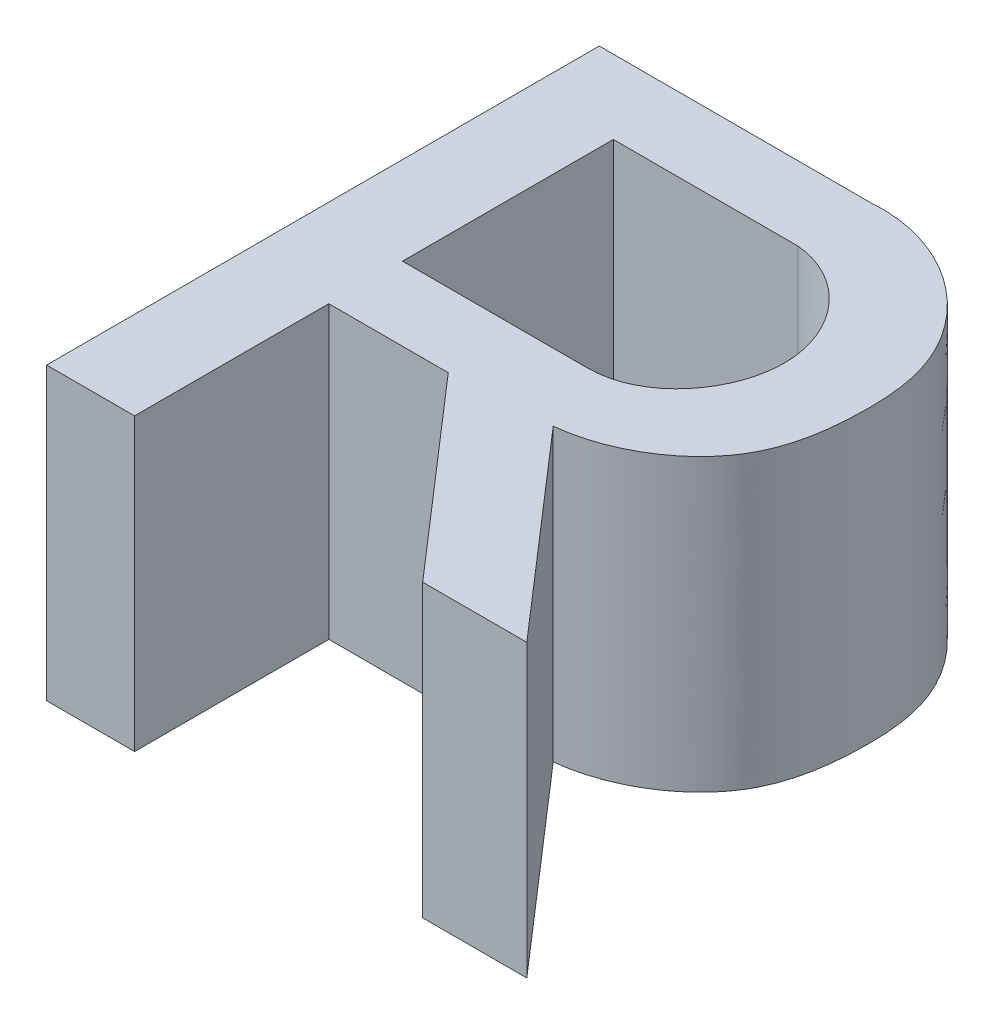
ISO-10303-21;
HEADER;
FILE_DESCRIPTION(('STEP AP214'),'2;1');
FILE_NAME('part.step','',(''),(''),'','','');
FILE_SCHEMA(('AUTOMOTIVE_DESIGN { 1 0 10303 214 1 1 1 1 }'));
ENDSEC;
DATA;
#1=APPLICATION_CONTEXT('core data for automotive mechanical design processes');
#2=APPLICATION_PROTOCOL_DEFINITION('international standard','automotive_design',2000,#1);
#3=PRODUCT_CONTEXT('',#1,'mechanical');
#4=PRODUCT('Part','Part','',(#3));
#5=PRODUCT_RELATED_PRODUCT_CATEGORY('part','',(#4));
#6=PRODUCT_DEFINITION_FORMATION('','',#4);
#7=PRODUCT_DEFINITION_CONTEXT('part definition',#1,'design');
#8=PRODUCT_DEFINITION('design','',#6,#7);
#9=PRODUCT_DEFINITION_SHAPE('','',#8);
#10=(LENGTH_UNIT() NAMED_UNIT(*) SI_UNIT(.MILLI.,.METRE.));
#11=(NAMED_UNIT(*) PLANE_ANGLE_UNIT() SI_UNIT($,.RADIAN.));
#12=(NAMED_UNIT(*) SI_UNIT($,.STERADIAN.) SOLID_ANGLE_UNIT());
#13=UNCERTAINTY_MEASURE_WITH_UNIT(LENGTH_MEASURE(1.E-05),#10,'distance_accuracy_value','');
#14=(GEOMETRIC_REPRESENTATION_CONTEXT(3) GLOBAL_UNCERTAINTY_ASSIGNED_CONTEXT((#13)) GLOBAL_UNIT_ASSIGNED_CONTEXT((#10,
#11,#12)) REPRESENTATION_CONTEXT('',''));
#15=CARTESIAN_POINT('',(0.,0.,0.));
#16=DIRECTION('',(0.,0.,1.));
#17=DIRECTION('',(1.,0.,0.));
#18=AXIS2_PLACEMENT_3D('',#15,#16,#17);
#19=CARTESIAN_POINT('',(235.710051450703,10.,-69.6814192494547));
#20=DIRECTION('',(0.,1.,0.));
#21=DIRECTION('',(0.,0.,1.));
#22=AXIS2_PLACEMENT_3D('',#19,#20,#21);
#23=PLANE('',#22);
#24=DIRECTION('',(0.,0.,-1.));
#25=VECTOR('',#24,1.);
#26=CARTESIAN_POINT('',(223.330371358063,10.,-56.28859622837));
#27=LINE('',#26,#25);
#28=CARTESIAN_POINT('',(223.330371358063,10.,-56.28859622837));
#29=VERTEX_POINT('',#28);
#30=CARTESIAN_POINT('',(223.330371358063,10.,-62.9695347702352));
#31=VERTEX_POINT('',#30);
#32=EDGE_CURVE('E169',#29,#31,#27,.T.);
#33=ORIENTED_EDGE('',*,*,#32,.T.);
#34=DIRECTION('',(1.,0.,0.));
#35=VECTOR('',#34,1.);
#36=CARTESIAN_POINT('',(223.330371358063,10.,-62.9695347702352));
#37=LINE('',#36,#35);
#38=CARTESIAN_POINT('',(227.439254650617,10.,-62.9695347702352));
#39=VERTEX_POINT('',#38);
#40=EDGE_CURVE('E172',#31,#39,#37,.T.);
#41=ORIENTED_EDGE('',*,*,#40,.T.);
#42=DIRECTION('',(0.655608052960158,0.,0.755101371269971));
#43=VECTOR('',#42,1.);
#44=CARTESIAN_POINT('',(227.439254650617,10.,-62.9695347702352));
#45=LINE('',#44,#43);
#46=CARTESIAN_POINT('',(233.239902452398,10.,-56.28859622837));
#47=VERTEX_POINT('',#46);
#48=EDGE_CURVE('E175',#39,#47,#45,.T.);
#49=ORIENTED_EDGE('',*,*,#48,.T.);
#50=DIRECTION('',(1.,0.,0.));
#51=VECTOR('',#50,1.);
#52=CARTESIAN_POINT('',(233.239902452398,10.,-56.28859622837));
#53=LINE('',#52,#51);
#54=CARTESIAN_POINT('',(236.821363026982,10.,-56.28859622837));
#55=VERTEX_POINT('',#54);
#56=EDGE_CURVE('E177',#47,#55,#53,.T.);
#57=ORIENTED_EDGE('',*,*,#56,.T.);
#58=DIRECTION('',(-0.655608052960158,0.,-0.755101371269971));
#59=VECTOR('',#58,1.);
#60=CARTESIAN_POINT('',(236.821363026982,10.,-56.28859622837));
#61=LINE('',#60,#59);
#62=CARTESIAN_POINT('',(230.838165169742,10.,-63.1797881321027));
#63=VERTEX_POINT('',#62);
#64=EDGE_CURVE('E179',#55,#63,#61,.T.);
#65=ORIENTED_EDGE('',*,*,#64,.T.);
#66=CARTESIAN_POINT('',(230.838165169742,10.,-63.1797881321027));
#67=CARTESIAN_POINT('',(232.468371290069,10.,-63.3435577018225));
#68=CARTESIAN_POINT('',(235.279114715755,10.,-64.9361339424328));
#69=CARTESIAN_POINT('',(235.816766574003,10.,-68.6325849303975));
#70=CARTESIAN_POINT('',(235.505907738658,10.,-73.0022945671736));
#71=CARTESIAN_POINT('',(232.182888405476,10.,-75.4901012806327));
#72=CARTESIAN_POINT('',(229.675442439864,10.,-75.2974570796293));
#73=B_SPLINE_CURVE_WITH_KNOTS('',3,(#66,#67,#68,#69,#70,#71,#72),.UNSPECIFIED.,.F.,.F.,(4,1,1,1,
4),(0.,0.281034740982533,0.453541249905517,0.592028659944323,1.),.UNSPECIFIED.);
#74=CARTESIAN_POINT('',(229.675442439864,10.,-75.2974570796293));
#75=VERTEX_POINT('',#74);
#76=EDGE_CURVE('E181',#63,#75,#73,.T.);
#77=ORIENTED_EDGE('',*,*,#76,.T.);
#78=DIRECTION('',(-1.,0.,0.));
#79=VECTOR('',#78,1.);
#80=CARTESIAN_POINT('',(220.304500587611,10.,-75.2974570796293));
#81=LINE('',#80,#79);
#82=CARTESIAN_POINT('',(220.304500587611,10.,-75.2974570796293));
#83=VERTEX_POINT('',#82);
#84=EDGE_CURVE('E186',#75,#83,#81,.T.);
#85=ORIENTED_EDGE('',*,*,#84,.T.);
#86=DIRECTION('',(0.,0.,1.));
#87=VECTOR('',#86,1.);
#88=CARTESIAN_POINT('',(220.304500587611,10.,-56.28859622837));
#89=LINE('',#88,#87);
#90=CARTESIAN_POINT('',(220.304500587611,10.,-56.28859622837));
#91=VERTEX_POINT('',#90);
#92=EDGE_CURVE('E311',#83,#91,#89,.T.);
#93=ORIENTED_EDGE('',*,*,#92,.T.);
#94=DIRECTION('',(1.,0.,0.));
#95=VECTOR('',#94,1.);
#96=CARTESIAN_POINT('',(223.330371358063,10.,-56.28859622837));
#97=LINE('',#96,#95);
#98=EDGE_CURVE('E255',#91,#29,#97,.T.);
#99=ORIENTED_EDGE('',*,*,#98,.T.);
#100=EDGE_LOOP('',(#33,#41,#49,#57,#65,#77,#85,#93,#99));
#101=FACE_BOUND('',#100,.T.);
#102=DIRECTION('',(-1.,0.,0.));
#103=VECTOR('',#102,1.);
#104=CARTESIAN_POINT('',(229.675442439864,10.,-72.7558121639152));
#105=LINE('',#104,#103);
#106=CARTESIAN_POINT('',(229.675442439864,10.,-72.7558121639152));
#107=VERTEX_POINT('',#106);
#108=CARTESIAN_POINT('',(223.330371358063,10.,-72.7558121639152));
#109=VERTEX_POINT('',#108);
#110=EDGE_CURVE('E133',#107,#109,#105,.T.);
#111=ORIENTED_EDGE('',*,*,#110,.F.);
#112=CARTESIAN_POINT('',(229.675442439864,10.,-65.5035744955742));
#113=CARTESIAN_POINT('',(231.613573249899,10.,-65.4838318681704));
#114=CARTESIAN_POINT('',(234.326804696503,10.,-69.15534348119));
#115=CARTESIAN_POINT('',(231.46341148948,10.,-72.5996370219874));
#116=CARTESIAN_POINT('',(229.675442439864,10.,-72.7558121639152));
#117=B_SPLINE_CURVE_WITH_KNOTS('',3,(#112,#113,#114,#115,#116),.UNSPECIFIED.,.F.,.F.,(4,1,4),
(0.,0.50437880501234,1.),.UNSPECIFIED.);
#118=CARTESIAN_POINT('',(229.675442439864,10.,-65.5035744955742));
#119=VERTEX_POINT('',#118);
#120=EDGE_CURVE('E125',#119,#107,#117,.T.);
#121=ORIENTED_EDGE('',*,*,#120,.F.);
#122=DIRECTION('',(1.,0.,0.));
#123=VECTOR('',#122,1.);
#124=CARTESIAN_POINT('',(223.330371358063,10.,-65.5035744955742));
#125=LINE('',#124,#123);
#126=CARTESIAN_POINT('',(223.330371358063,10.,-65.5035744955742));
#127=VERTEX_POINT('',#126);
#128=EDGE_CURVE('E147',#127,#119,#125,.T.);
#129=ORIENTED_EDGE('',*,*,#128,.F.);
#130=DIRECTION('',(0.,0.,1.));
#131=VECTOR('',#130,1.);
#132=CARTESIAN_POINT('',(223.330371358063,10.,-72.7558121639152));
#133=LINE('',#132,#131);
#134=EDGE_CURVE('E145',#109,#127,#133,.T.);
#135=ORIENTED_EDGE('',*,*,#134,.F.);
#136=EDGE_LOOP('',(#111,#121,#129,#135));
#137=FACE_BOUND('',#136,.T.);
#138=ADVANCED_FACE('F30',(#101,#137),#23,.T.);
#139=CARTESIAN_POINT('',(235.710051450703,0.,-69.6814192494547));
#140=DIRECTION('',(0.,1.,0.));
#141=DIRECTION('',(0.,0.,1.));
#142=AXIS2_PLACEMENT_3D('',#139,#140,#141);
#143=PLANE('',#142);
#144=DIRECTION('',(0.,0.,-1.));
#145=VECTOR('',#144,1.);
#146=CARTESIAN_POINT('',(223.330371358063,0.,-56.28859622837));
#147=LINE('',#146,#145);
#148=CARTESIAN_POINT('',(223.330371358063,0.,-56.28859622837));
#149=VERTEX_POINT('',#148);
#150=CARTESIAN_POINT('',(223.330371358063,0.,-62.9695347702352));
#151=VERTEX_POINT('',#150);
#152=EDGE_CURVE('E141',#149,#151,#147,.T.);
#153=ORIENTED_EDGE('',*,*,#152,.F.);
#154=DIRECTION('',(1.,0.,0.));
#155=VECTOR('',#154,1.);
#156=CARTESIAN_POINT('',(223.330371358063,0.,-56.28859622837));
#157=LINE('',#156,#155);
#158=CARTESIAN_POINT('',(220.304500587611,0.,-56.28859622837));
#159=VERTEX_POINT('',#158);
#160=EDGE_CURVE('E173',#159,#149,#157,.T.);
#161=ORIENTED_EDGE('',*,*,#160,.F.);
#162=DIRECTION('',(0.,0.,1.));
#163=VECTOR('',#162,1.);
#164=CARTESIAN_POINT('',(220.304500587611,0.,-56.28859622837));
#165=LINE('',#164,#163);
#166=CARTESIAN_POINT('',(220.304500587611,0.,-75.2974570796293));
#167=VERTEX_POINT('',#166);
#168=EDGE_CURVE('E242',#167,#159,#165,.T.);
#169=ORIENTED_EDGE('',*,*,#168,.F.);
#170=DIRECTION('',(-1.,0.,0.));
#171=VECTOR('',#170,1.);
#172=CARTESIAN_POINT('',(220.304500587611,0.,-75.2974570796293));
#173=LINE('',#172,#171);
#174=CARTESIAN_POINT('',(229.675442439864,0.,-75.2974570796293));
#175=VERTEX_POINT('',#174);
#176=EDGE_CURVE('E251',#175,#167,#173,.T.);
#177=ORIENTED_EDGE('',*,*,#176,.F.);
#178=CARTESIAN_POINT('',(230.838165169742,0.,-63.1797881321027));
#179=CARTESIAN_POINT('',(232.468371290069,0.,-63.3435577018225));
#180=CARTESIAN_POINT('',(235.279114715755,0.,-64.9361339424328));
#181=CARTESIAN_POINT('',(235.816766574003,0.,-68.6325849303975));
#182=CARTESIAN_POINT('',(235.505907738658,0.,-73.0022945671736));
#183=CARTESIAN_POINT('',(232.182888405476,0.,-75.4901012806327));
#184=CARTESIAN_POINT('',(229.675442439864,0.,-75.2974570796293));
#185=B_SPLINE_CURVE_WITH_KNOTS('',3,(#178,#179,#180,#181,#182,#183,#184),.UNSPECIFIED.,.F.,.F.,
(4,1,1,1,4),(0.,0.281034740982533,0.453541249905517,0.592028659944323,1.),.UNSPECIFIED.);
#186=CARTESIAN_POINT('',(230.838165169742,0.,-63.1797881321027));
#187=VERTEX_POINT('',#186);
#188=EDGE_CURVE('E294',#187,#175,#185,.T.);
#189=ORIENTED_EDGE('',*,*,#188,.F.);
#190=DIRECTION('',(-0.655608052960158,0.,-0.755101371269971));
#191=VECTOR('',#190,1.);
#192=CARTESIAN_POINT('',(236.821363026982,0.,-56.28859622837));
#193=LINE('',#192,#191);
#194=CARTESIAN_POINT('',(236.821363026982,0.,-56.28859622837));
#195=VERTEX_POINT('',#194);
#196=EDGE_CURVE('E288',#195,#187,#193,.T.);
#197=ORIENTED_EDGE('',*,*,#196,.F.);
#198=DIRECTION('',(1.,0.,0.));
#199=VECTOR('',#198,1.);
#200=CARTESIAN_POINT('',(233.239902452398,0.,-56.28859622837));
#201=LINE('',#200,#199);
#202=CARTESIAN_POINT('',(233.239902452398,0.,-56.28859622837));
#203=VERTEX_POINT('',#202);
#204=EDGE_CURVE('E286',#203,#195,#201,.T.);
#205=ORIENTED_EDGE('',*,*,#204,.F.);
#206=DIRECTION('',(0.655608052960158,0.,0.755101371269971));
#207=VECTOR('',#206,1.);
#208=CARTESIAN_POINT('',(227.439254650617,0.,-62.9695347702352));
#209=LINE('',#208,#207);
#210=CARTESIAN_POINT('',(227.439254650617,0.,-62.9695347702352));
#211=VERTEX_POINT('',#210);
#212=EDGE_CURVE('E282',#211,#203,#209,.T.);
#213=ORIENTED_EDGE('',*,*,#212,.F.);
#214=DIRECTION('',(1.,0.,0.));
#215=VECTOR('',#214,1.);
#216=CARTESIAN_POINT('',(223.330371358063,0.,-62.9695347702352));
#217=LINE('',#216,#215);
#218=EDGE_CURVE('E284',#151,#211,#217,.T.);
#219=ORIENTED_EDGE('',*,*,#218,.F.);
#220=EDGE_LOOP('',(#153,#161,#169,#177,#189,#197,#205,#213,#219));
#221=FACE_BOUND('',#220,.T.);
#222=CARTESIAN_POINT('',(229.675442439864,0.,-65.5035744955742));
#223=CARTESIAN_POINT('',(231.613573249899,0.,-65.4838318681704));
#224=CARTESIAN_POINT('',(234.326804696503,0.,-69.15534348119));
#225=CARTESIAN_POINT('',(231.46341148948,0.,-72.5996370219874));
#226=CARTESIAN_POINT('',(229.675442439864,0.,-72.7558121639152));
#227=B_SPLINE_CURVE_WITH_KNOTS('',3,(#222,#223,#224,#225,#226),.UNSPECIFIED.,.F.,.F.,(4,1,4),
(0.,0.50437880501234,1.),.UNSPECIFIED.);
#228=CARTESIAN_POINT('',(229.675442439864,0.,-65.5035744955742));
#229=VERTEX_POINT('',#228);
#230=CARTESIAN_POINT('',(229.675442439864,0.,-72.7558121639152));
#231=VERTEX_POINT('',#230);
#232=EDGE_CURVE('E53',#229,#231,#227,.T.);
#233=ORIENTED_EDGE('',*,*,#232,.T.);
#234=DIRECTION('',(-1.,0.,0.));
#235=VECTOR('',#234,1.);
#236=CARTESIAN_POINT('',(229.675442439864,0.,-72.7558121639152));
#237=LINE('',#236,#235);
#238=CARTESIAN_POINT('',(223.330371358063,0.,-72.7558121639152));
#239=VERTEX_POINT('',#238);
#240=EDGE_CURVE('E140',#231,#239,#237,.T.);
#241=ORIENTED_EDGE('',*,*,#240,.T.);
#242=DIRECTION('',(0.,0.,1.));
#243=VECTOR('',#242,1.);
#244=CARTESIAN_POINT('',(223.330371358063,0.,-72.7558121639152));
#245=LINE('',#244,#243);
#246=CARTESIAN_POINT('',(223.330371358063,0.,-65.5035744955742));
#247=VERTEX_POINT('',#246);
#248=EDGE_CURVE('E161',#239,#247,#245,.T.);
#249=ORIENTED_EDGE('',*,*,#248,.T.);
#250=DIRECTION('',(1.,0.,0.));
#251=VECTOR('',#250,1.);
#252=CARTESIAN_POINT('',(223.330371358063,0.,-65.5035744955742));
#253=LINE('',#252,#251);
#254=EDGE_CURVE('E134',#247,#229,#253,.T.);
#255=ORIENTED_EDGE('',*,*,#254,.T.);
#256=EDGE_LOOP('',(#233,#241,#249,#255));
#257=FACE_BOUND('',#256,.T.);
#258=ADVANCED_FACE('F216',(#221,#257),#143,.F.);
#259=CARTESIAN_POINT('',(223.330371358063,10.,-56.28859622837));
#260=DIRECTION('',(-1.,0.,0.));
#261=DIRECTION('',(0.,0.,1.));
#262=AXIS2_PLACEMENT_3D('',#259,#260,#261);
#263=PLANE('',#262);
#264=ORIENTED_EDGE('',*,*,#152,.T.);
#265=DIRECTION('',(0.,-1.,0.));
#266=VECTOR('',#265,1.);
#267=CARTESIAN_POINT('',(223.330371358063,10.,-62.9695347702352));
#268=LINE('',#267,#266);
#269=EDGE_CURVE('E11',#31,#151,#268,.T.);
#270=ORIENTED_EDGE('',*,*,#269,.F.);
#271=ORIENTED_EDGE('',*,*,#32,.F.);
#272=DIRECTION('',(0.,-1.,0.));
#273=VECTOR('',#272,1.);
#274=CARTESIAN_POINT('',(223.330371358063,10.,-56.28859622837));
#275=LINE('',#274,#273);
#276=EDGE_CURVE('E256',#29,#149,#275,.T.);
#277=ORIENTED_EDGE('',*,*,#276,.T.);
#278=EDGE_LOOP('',(#264,#270,#271,#277));
#279=FACE_BOUND('',#278,.T.);
#280=ADVANCED_FACE('F32',(#279),#263,.F.);
#281=CARTESIAN_POINT('',(223.330371358063,10.,-62.9695347702352));
#282=DIRECTION('',(0.,0.,-1.));
#283=DIRECTION('',(-1.,0.,0.));
#284=AXIS2_PLACEMENT_3D('',#281,#282,#283);
#285=PLANE('',#284);
#286=ORIENTED_EDGE('',*,*,#218,.T.);
#287=DIRECTION('',(0.,-1.,0.));
#288=VECTOR('',#287,1.);
#289=CARTESIAN_POINT('',(227.439254650617,10.,-62.9695347702352));
#290=LINE('',#289,#288);
#291=EDGE_CURVE('E38',#39,#211,#290,.T.);
#292=ORIENTED_EDGE('',*,*,#291,.F.);
#293=ORIENTED_EDGE('',*,*,#40,.F.);
#294=ORIENTED_EDGE('',*,*,#269,.T.);
#295=EDGE_LOOP('',(#286,#292,#293,#294));
#296=FACE_BOUND('',#295,.T.);
#297=ADVANCED_FACE('F209',(#296),#285,.F.);
#298=CARTESIAN_POINT('',(227.439254650617,10.,-62.9695347702352));
#299=DIRECTION('',(0.755101371269972,0.,-0.655608052960158));
#300=DIRECTION('',(-0.655608052960158,0.,-0.755101371269972));
#301=AXIS2_PLACEMENT_3D('',#298,#299,#300);
#302=PLANE('',#301);
#303=ORIENTED_EDGE('',*,*,#212,.T.);
#304=DIRECTION('',(0.,-1.,0.));
#305=VECTOR('',#304,1.);
#306=CARTESIAN_POINT('',(233.239902452398,10.,-56.28859622837));
#307=LINE('',#306,#305);
#308=EDGE_CURVE('E275',#47,#203,#307,.T.);
#309=ORIENTED_EDGE('',*,*,#308,.F.);
#310=ORIENTED_EDGE('',*,*,#48,.F.);
#311=ORIENTED_EDGE('',*,*,#291,.T.);
#312=EDGE_LOOP('',(#303,#309,#310,#311));
#313=FACE_BOUND('',#312,.T.);
#314=ADVANCED_FACE('F206',(#313),#302,.F.);
#315=CARTESIAN_POINT('',(233.239902452398,10.,-56.28859622837));
#316=DIRECTION('',(0.,0.,-1.));
#317=DIRECTION('',(-1.,0.,0.));
#318=AXIS2_PLACEMENT_3D('',#315,#316,#317);
#319=PLANE('',#318);
#320=ORIENTED_EDGE('',*,*,#204,.T.);
#321=DIRECTION('',(0.,-1.,0.));
#322=VECTOR('',#321,1.);
#323=CARTESIAN_POINT('',(236.821363026982,10.,-56.28859622837));
#324=LINE('',#323,#322);
#325=EDGE_CURVE('E272',#55,#195,#324,.T.);
#326=ORIENTED_EDGE('',*,*,#325,.F.);
#327=ORIENTED_EDGE('',*,*,#56,.F.);
#328=ORIENTED_EDGE('',*,*,#308,.T.);
#329=EDGE_LOOP('',(#320,#326,#327,#328));
#330=FACE_BOUND('',#329,.T.);
#331=ADVANCED_FACE('F202',(#330),#319,.F.);
#332=CARTESIAN_POINT('',(236.821363026982,10.,-56.28859622837));
#333=DIRECTION('',(-0.755101371269971,0.,0.655608052960158));
#334=DIRECTION('',(0.655608052960158,0.,0.755101371269971));
#335=AXIS2_PLACEMENT_3D('',#332,#333,#334);
#336=PLANE('',#335);
#337=ORIENTED_EDGE('',*,*,#196,.T.);
#338=DIRECTION('',(0.,-1.,0.));
#339=VECTOR('',#338,1.);
#340=CARTESIAN_POINT('',(230.838165169742,10.,-63.1797881321027));
#341=LINE('',#340,#339);
#342=EDGE_CURVE('E269',#63,#187,#341,.T.);
#343=ORIENTED_EDGE('',*,*,#342,.F.);
#344=ORIENTED_EDGE('',*,*,#64,.F.);
#345=ORIENTED_EDGE('',*,*,#325,.T.);
#346=EDGE_LOOP('',(#337,#343,#344,#345));
#347=FACE_BOUND('',#346,.T.);
#348=ADVANCED_FACE('F197',(#347),#336,.F.);
#349=DIRECTION('',(0.,-1.,0.));
#350=VECTOR('',#349,1.);
#351=SURFACE_OF_LINEAR_EXTRUSION('',#73,#350);
#352=ORIENTED_EDGE('',*,*,#188,.T.);
#353=DIRECTION('',(0.,-1.,0.));
#354=VECTOR('',#353,1.);
#355=CARTESIAN_POINT('',(229.675442439864,10.,-75.2974570796293));
#356=LINE('',#355,#354);
#357=EDGE_CURVE('E266',#75,#175,#356,.T.);
#358=ORIENTED_EDGE('',*,*,#357,.F.);
#359=ORIENTED_EDGE('',*,*,#76,.F.);
#360=ORIENTED_EDGE('',*,*,#342,.T.);
#361=EDGE_LOOP('',(#352,#358,#359,#360));
#362=FACE_BOUND('',#361,.T.);
#363=ADVANCED_FACE('F192',(#362),#351,.F.);
#364=CARTESIAN_POINT('',(220.304500587611,10.,-75.2974570796293));
#365=DIRECTION('',(0.,0.,1.));
#366=DIRECTION('',(1.,0.,0.));
#367=AXIS2_PLACEMENT_3D('',#364,#365,#366);
#368=PLANE('',#367);
#369=ORIENTED_EDGE('',*,*,#176,.T.);
#370=DIRECTION('',(0.,-1.,0.));
#371=VECTOR('',#370,1.);
#372=CARTESIAN_POINT('',(220.304500587611,10.,-75.2974570796293));
#373=LINE('',#372,#371);
#374=EDGE_CURVE('E248',#83,#167,#373,.T.);
#375=ORIENTED_EDGE('',*,*,#374,.F.);
#376=ORIENTED_EDGE('',*,*,#84,.F.);
#377=ORIENTED_EDGE('',*,*,#357,.T.);
#378=EDGE_LOOP('',(#369,#375,#376,#377));
#379=FACE_BOUND('',#378,.T.);
#380=ADVANCED_FACE('F196',(#379),#368,.F.);
#381=CARTESIAN_POINT('',(220.304500587611,10.,-56.28859622837));
#382=DIRECTION('',(1.,0.,0.));
#383=DIRECTION('',(0.,0.,-1.));
#384=AXIS2_PLACEMENT_3D('',#381,#382,#383);
#385=PLANE('',#384);
#386=ORIENTED_EDGE('',*,*,#168,.T.);
#387=DIRECTION('',(0.,-1.,0.));
#388=VECTOR('',#387,1.);
#389=CARTESIAN_POINT('',(220.304500587611,10.,-56.28859622837));
#390=LINE('',#389,#388);
#391=EDGE_CURVE('E245',#91,#159,#390,.T.);
#392=ORIENTED_EDGE('',*,*,#391,.F.);
#393=ORIENTED_EDGE('',*,*,#92,.F.);
#394=ORIENTED_EDGE('',*,*,#374,.T.);
#395=EDGE_LOOP('',(#386,#392,#393,#394));
#396=FACE_BOUND('',#395,.T.);
#397=ADVANCED_FACE('F231',(#396),#385,.F.);
#398=CARTESIAN_POINT('',(223.330371358063,10.,-56.28859622837));
#399=DIRECTION('',(0.,0.,-1.));
#400=DIRECTION('',(-1.,0.,0.));
#401=AXIS2_PLACEMENT_3D('',#398,#399,#400);
#402=PLANE('',#401);
#403=ORIENTED_EDGE('',*,*,#160,.T.);
#404=ORIENTED_EDGE('',*,*,#276,.F.);
#405=ORIENTED_EDGE('',*,*,#98,.F.);
#406=ORIENTED_EDGE('',*,*,#391,.T.);
#407=EDGE_LOOP('',(#403,#404,#405,#406));
#408=FACE_BOUND('',#407,.T.);
#409=ADVANCED_FACE('F229',(#408),#402,.F.);
#410=DIRECTION('',(0.,-1.,0.));
#411=VECTOR('',#410,1.);
#412=SURFACE_OF_LINEAR_EXTRUSION('',#117,#411);
#413=ORIENTED_EDGE('',*,*,#232,.F.);
#414=DIRECTION('',(0.,-1.,0.));
#415=VECTOR('',#414,1.);
#416=CARTESIAN_POINT('',(229.675442439864,10.,-65.5035744955742));
#417=LINE('',#416,#415);
#418=EDGE_CURVE('E129',#119,#229,#417,.T.);
#419=ORIENTED_EDGE('',*,*,#418,.F.);
#420=ORIENTED_EDGE('',*,*,#120,.T.);
#421=DIRECTION('',(0.,-1.,0.));
#422=VECTOR('',#421,1.);
#423=CARTESIAN_POINT('',(229.675442439864,10.,-72.7558121639152));
#424=LINE('',#423,#422);
#425=EDGE_CURVE('E128',#107,#231,#424,.T.);
#426=ORIENTED_EDGE('',*,*,#425,.T.);
#427=EDGE_LOOP('',(#413,#419,#420,#426));
#428=FACE_BOUND('',#427,.T.);
#429=ADVANCED_FACE('F127',(#428),#412,.T.);
#430=CARTESIAN_POINT('',(229.675442439864,10.,-72.7558121639152));
#431=DIRECTION('',(0.,0.,1.));
#432=DIRECTION('',(1.,0.,0.));
#433=AXIS2_PLACEMENT_3D('',#430,#431,#432);
#434=PLANE('',#433);
#435=ORIENTED_EDGE('',*,*,#240,.F.);
#436=ORIENTED_EDGE('',*,*,#425,.F.);
#437=ORIENTED_EDGE('',*,*,#110,.T.);
#438=DIRECTION('',(0.,-1.,0.));
#439=VECTOR('',#438,1.);
#440=CARTESIAN_POINT('',(223.330371358063,10.,-72.7558121639152));
#441=LINE('',#440,#439);
#442=EDGE_CURVE('E142',#109,#239,#441,.T.);
#443=ORIENTED_EDGE('',*,*,#442,.T.);
#444=EDGE_LOOP('',(#435,#436,#437,#443));
#445=FACE_BOUND('',#444,.T.);
#446=ADVANCED_FACE('F137',(#445),#434,.T.);
#447=CARTESIAN_POINT('',(223.330371358063,10.,-72.7558121639152));
#448=DIRECTION('',(1.,0.,0.));
#449=DIRECTION('',(0.,0.,-1.));
#450=AXIS2_PLACEMENT_3D('',#447,#448,#449);
#451=PLANE('',#450);
#452=ORIENTED_EDGE('',*,*,#248,.F.);
#453=ORIENTED_EDGE('',*,*,#442,.F.);
#454=ORIENTED_EDGE('',*,*,#134,.T.);
#455=DIRECTION('',(0.,-1.,0.));
#456=VECTOR('',#455,1.);
#457=CARTESIAN_POINT('',(223.330371358063,10.,-65.5035744955742));
#458=LINE('',#457,#456);
#459=EDGE_CURVE('E45',#127,#247,#458,.T.);
#460=ORIENTED_EDGE('',*,*,#459,.T.);
#461=EDGE_LOOP('',(#452,#453,#454,#460));
#462=FACE_BOUND('',#461,.T.);
#463=ADVANCED_FACE('F315',(#462),#451,.T.);
#464=CARTESIAN_POINT('',(223.330371358063,10.,-65.5035744955742));
#465=DIRECTION('',(0.,0.,-1.));
#466=DIRECTION('',(-1.,0.,0.));
#467=AXIS2_PLACEMENT_3D('',#464,#465,#466);
#468=PLANE('',#467);
#469=ORIENTED_EDGE('',*,*,#254,.F.);
#470=ORIENTED_EDGE('',*,*,#459,.F.);
#471=ORIENTED_EDGE('',*,*,#128,.T.);
#472=ORIENTED_EDGE('',*,*,#418,.T.);
#473=EDGE_LOOP('',(#469,#470,#471,#472));
#474=FACE_BOUND('',#473,.T.);
#475=ADVANCED_FACE('F313',(#474),#468,.T.);
#476=CLOSED_SHELL('',(#138,#258,#280,#297,#314,#331,#348,#363,#380,#397,#409,#429,#446,#463,#475));
#477=MANIFOLD_SOLID_BREP('B2',#476);
#478=ADVANCED_BREP_SHAPE_REPRESENTATION('',(#18,#477),#14);
#479=SHAPE_DEFINITION_REPRESENTATION(#9,#478);
ENDSEC;
END-ISO-10303-21;
